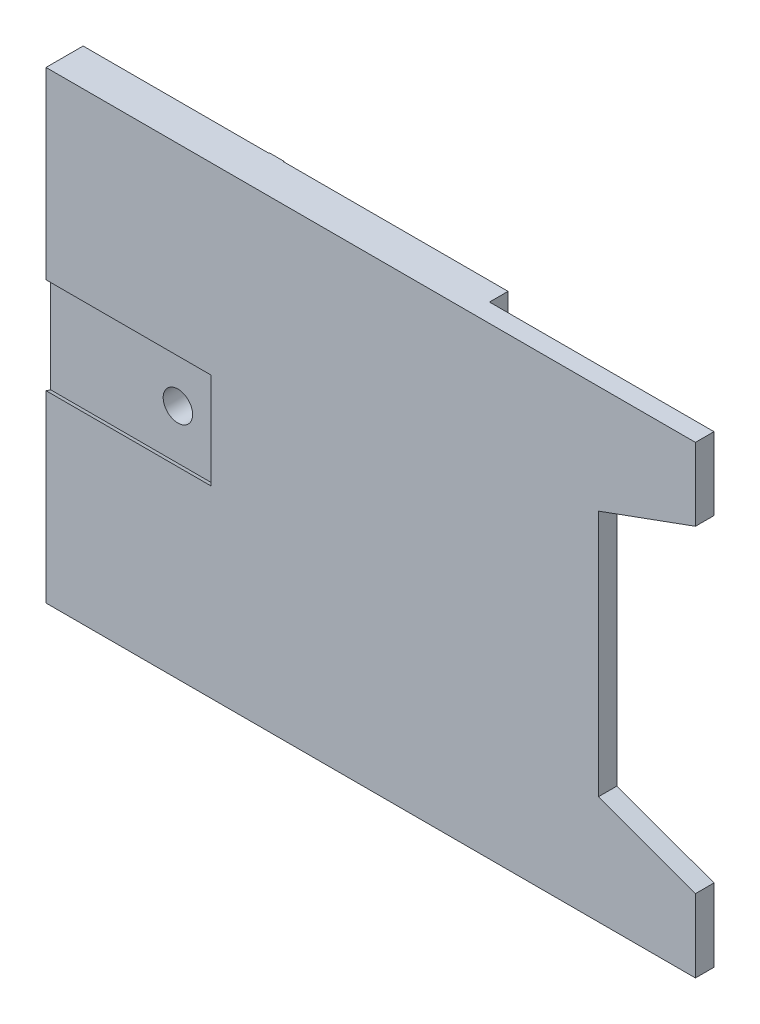
ISO-10303-21;
HEADER;
FILE_DESCRIPTION(('STEP AP214'),'2;1');
FILE_NAME('part.step','',(''),(''),'','','');
FILE_SCHEMA(('AUTOMOTIVE_DESIGN { 1 0 10303 214 1 1 1 1 }'));
ENDSEC;
DATA;
#1=APPLICATION_CONTEXT('core data for automotive mechanical design processes');
#2=APPLICATION_PROTOCOL_DEFINITION('international standard','automotive_design',2000,#1);
#3=PRODUCT_CONTEXT('',#1,'mechanical');
#4=PRODUCT('Part','Part','',(#3));
#5=PRODUCT_RELATED_PRODUCT_CATEGORY('part','',(#4));
#6=PRODUCT_DEFINITION_FORMATION('','',#4);
#7=PRODUCT_DEFINITION_CONTEXT('part definition',#1,'design');
#8=PRODUCT_DEFINITION('design','',#6,#7);
#9=PRODUCT_DEFINITION_SHAPE('','',#8);
#10=(LENGTH_UNIT() NAMED_UNIT(*) SI_UNIT(.MILLI.,.METRE.));
#11=(NAMED_UNIT(*) PLANE_ANGLE_UNIT() SI_UNIT($,.RADIAN.));
#12=(NAMED_UNIT(*) SI_UNIT($,.STERADIAN.) SOLID_ANGLE_UNIT());
#13=UNCERTAINTY_MEASURE_WITH_UNIT(LENGTH_MEASURE(1.E-05),#10,'distance_accuracy_value','');
#14=(GEOMETRIC_REPRESENTATION_CONTEXT(3) GLOBAL_UNCERTAINTY_ASSIGNED_CONTEXT((#13)) GLOBAL_UNIT_ASSIGNED_CONTEXT((#10,
#11,#12)) REPRESENTATION_CONTEXT('',''));
#15=CARTESIAN_POINT('',(0.,0.,0.));
#16=DIRECTION('',(0.,0.,1.));
#17=DIRECTION('',(1.,0.,0.));
#18=AXIS2_PLACEMENT_3D('',#15,#16,#17);
#19=CARTESIAN_POINT('',(0.,0.,4.));
#20=DIRECTION('',(0.,1.,0.));
#21=DIRECTION('',(0.,0.,1.));
#22=AXIS2_PLACEMENT_3D('',#19,#20,#21);
#23=PLANE('',#22);
#24=DIRECTION('',(0.,0.,1.));
#25=VECTOR('',#24,1.);
#26=CARTESIAN_POINT('',(25.8029900343161,0.,0.));
#27=LINE('',#26,#25);
#28=CARTESIAN_POINT('',(25.8029900343161,0.,0.));
#29=VERTEX_POINT('',#28);
#30=CARTESIAN_POINT('',(25.8029900343161,0.,2.));
#31=VERTEX_POINT('',#30);
#32=EDGE_CURVE('E298',#29,#31,#27,.T.);
#33=ORIENTED_EDGE('',*,*,#32,.T.);
#34=DIRECTION('',(1.,0.,0.));
#35=VECTOR('',#34,1.);
#36=CARTESIAN_POINT('',(25.8029900343161,0.,2.));
#37=LINE('',#36,#35);
#38=CARTESIAN_POINT('',(50.,0.,2.));
#39=VERTEX_POINT('',#38);
#40=EDGE_CURVE('E301',#31,#39,#37,.T.);
#41=ORIENTED_EDGE('',*,*,#40,.T.);
#42=DIRECTION('',(0.,0.,-1.));
#43=VECTOR('',#42,1.);
#44=CARTESIAN_POINT('',(50.,0.,4.));
#45=LINE('',#44,#43);
#46=CARTESIAN_POINT('',(50.,0.,4.));
#47=VERTEX_POINT('',#46);
#48=EDGE_CURVE('E11',#47,#39,#45,.T.);
#49=ORIENTED_EDGE('',*,*,#48,.F.);
#50=DIRECTION('',(1.,0.,0.));
#51=VECTOR('',#50,1.);
#52=CARTESIAN_POINT('',(0.,0.,4.));
#53=LINE('',#52,#51);
#54=CARTESIAN_POINT('',(-20.,0.,4.));
#55=VERTEX_POINT('',#54);
#56=EDGE_CURVE('E327',#55,#47,#53,.T.);
#57=ORIENTED_EDGE('',*,*,#56,.F.);
#58=DIRECTION('',(0.,0.,1.));
#59=VECTOR('',#58,1.);
#60=CARTESIAN_POINT('',(-20.,0.,0.));
#61=LINE('',#60,#59);
#62=CARTESIAN_POINT('',(-20.,0.,0.));
#63=VERTEX_POINT('',#62);
#64=EDGE_CURVE('E283',#63,#55,#61,.T.);
#65=ORIENTED_EDGE('',*,*,#64,.F.);
#66=DIRECTION('',(1.,0.,0.));
#67=VECTOR('',#66,1.);
#68=CARTESIAN_POINT('',(0.,0.,0.));
#69=LINE('',#68,#67);
#70=EDGE_CURVE('E326',#63,#29,#69,.T.);
#71=ORIENTED_EDGE('',*,*,#70,.T.);
#72=EDGE_LOOP('',(#33,#41,#49,#57,#65,#71));
#73=FACE_BOUND('',#72,.T.);
#74=ADVANCED_FACE('F35',(#73),#23,.F.);
#75=CARTESIAN_POINT('',(50.,0.,4.));
#76=DIRECTION('',(-1.,0.,0.));
#77=DIRECTION('',(0.,-1.,0.));
#78=AXIS2_PLACEMENT_3D('',#75,#76,#77);
#79=PLANE('',#78);
#80=ORIENTED_EDGE('',*,*,#48,.T.);
#81=DIRECTION('',(0.,1.,0.));
#82=VECTOR('',#81,1.);
#83=CARTESIAN_POINT('',(50.,0.,2.));
#84=LINE('',#83,#82);
#85=CARTESIAN_POINT('',(50.,7.874,2.));
#86=VERTEX_POINT('',#85);
#87=EDGE_CURVE('E310',#39,#86,#84,.T.);
#88=ORIENTED_EDGE('',*,*,#87,.T.);
#89=DIRECTION('',(0.,0.,-1.));
#90=VECTOR('',#89,1.);
#91=CARTESIAN_POINT('',(50.,7.874,4.));
#92=LINE('',#91,#90);
#93=CARTESIAN_POINT('',(50.,7.874,4.));
#94=VERTEX_POINT('',#93);
#95=EDGE_CURVE('E43',#94,#86,#92,.T.);
#96=ORIENTED_EDGE('',*,*,#95,.F.);
#97=DIRECTION('',(0.,1.,0.));
#98=VECTOR('',#97,1.);
#99=CARTESIAN_POINT('',(50.,0.,4.));
#100=LINE('',#99,#98);
#101=EDGE_CURVE('E329',#47,#94,#100,.T.);
#102=ORIENTED_EDGE('',*,*,#101,.F.);
#103=EDGE_LOOP('',(#80,#88,#96,#102));
#104=FACE_BOUND('',#103,.T.);
#105=ADVANCED_FACE('F370',(#104),#79,.F.);
#106=CARTESIAN_POINT('',(39.535978332,11.684,4.));
#107=DIRECTION('',(-0.342131753657188,-0.939651990440853,0.));
#108=DIRECTION('',(0.939651990440853,-0.342131753657188,0.));
#109=AXIS2_PLACEMENT_3D('',#106,#107,#108);
#110=PLANE('',#109);
#111=ORIENTED_EDGE('',*,*,#95,.T.);
#112=DIRECTION('',(-0.939651990440853,0.342131753657188,0.));
#113=VECTOR('',#112,1.);
#114=CARTESIAN_POINT('',(39.535978332,11.684,2.));
#115=LINE('',#114,#113);
#116=CARTESIAN_POINT('',(39.535978332,11.684,2.));
#117=VERTEX_POINT('',#116);
#118=EDGE_CURVE('E323',#86,#117,#115,.T.);
#119=ORIENTED_EDGE('',*,*,#118,.T.);
#120=DIRECTION('',(0.,0.,-1.));
#121=VECTOR('',#120,1.);
#122=CARTESIAN_POINT('',(39.535978332,11.684,4.));
#123=LINE('',#122,#121);
#124=CARTESIAN_POINT('',(39.535978332,11.684,4.));
#125=VERTEX_POINT('',#124);
#126=EDGE_CURVE('E357',#125,#117,#123,.T.);
#127=ORIENTED_EDGE('',*,*,#126,.F.);
#128=DIRECTION('',(-0.939651990440853,0.342131753657188,0.));
#129=VECTOR('',#128,1.);
#130=CARTESIAN_POINT('',(39.535978332,11.684,4.));
#131=LINE('',#130,#129);
#132=EDGE_CURVE('E331',#94,#125,#131,.T.);
#133=ORIENTED_EDGE('',*,*,#132,.F.);
#134=EDGE_LOOP('',(#111,#119,#127,#133));
#135=FACE_BOUND('',#134,.T.);
#136=ADVANCED_FACE('F366',(#135),#110,.F.);
#137=CARTESIAN_POINT('',(39.535978332,38.354,4.));
#138=DIRECTION('',(-1.,0.,0.));
#139=DIRECTION('',(0.,-1.,0.));
#140=AXIS2_PLACEMENT_3D('',#137,#138,#139);
#141=PLANE('',#140);
#142=ORIENTED_EDGE('',*,*,#126,.T.);
#143=DIRECTION('',(0.,1.,0.));
#144=VECTOR('',#143,1.);
#145=CARTESIAN_POINT('',(39.535978332,38.354,2.));
#146=LINE('',#145,#144);
#147=CARTESIAN_POINT('',(39.535978332,38.354,2.));
#148=VERTEX_POINT('',#147);
#149=EDGE_CURVE('E320',#117,#148,#146,.T.);
#150=ORIENTED_EDGE('',*,*,#149,.T.);
#151=DIRECTION('',(0.,0.,-1.));
#152=VECTOR('',#151,1.);
#153=CARTESIAN_POINT('',(39.535978332,38.354,4.));
#154=LINE('',#153,#152);
#155=CARTESIAN_POINT('',(39.535978332,38.354,4.));
#156=VERTEX_POINT('',#155);
#157=EDGE_CURVE('E354',#156,#148,#154,.T.);
#158=ORIENTED_EDGE('',*,*,#157,.F.);
#159=DIRECTION('',(0.,1.,0.));
#160=VECTOR('',#159,1.);
#161=CARTESIAN_POINT('',(39.535978332,38.354,4.));
#162=LINE('',#161,#160);
#163=EDGE_CURVE('E333',#125,#156,#162,.T.);
#164=ORIENTED_EDGE('',*,*,#163,.F.);
#165=EDGE_LOOP('',(#142,#150,#158,#164));
#166=FACE_BOUND('',#165,.T.);
#167=ADVANCED_FACE('F402',(#166),#141,.F.);
#168=CARTESIAN_POINT('',(39.535978332,38.354,4.));
#169=DIRECTION('',(-0.342131753657188,0.939651990440853,0.));
#170=DIRECTION('',(-0.939651990440853,-0.342131753657188,0.));
#171=AXIS2_PLACEMENT_3D('',#168,#169,#170);
#172=PLANE('',#171);
#173=ORIENTED_EDGE('',*,*,#157,.T.);
#174=DIRECTION('',(0.939651990440853,0.342131753657188,0.));
#175=VECTOR('',#174,1.);
#176=CARTESIAN_POINT('',(39.535978332,38.354,2.));
#177=LINE('',#176,#175);
#178=CARTESIAN_POINT('',(50.,42.164,2.));
#179=VERTEX_POINT('',#178);
#180=EDGE_CURVE('E313',#148,#179,#177,.T.);
#181=ORIENTED_EDGE('',*,*,#180,.T.);
#182=DIRECTION('',(0.,0.,-1.));
#183=VECTOR('',#182,1.);
#184=CARTESIAN_POINT('',(50.,42.164,4.));
#185=LINE('',#184,#183);
#186=CARTESIAN_POINT('',(50.,42.164,4.));
#187=VERTEX_POINT('',#186);
#188=EDGE_CURVE('E351',#187,#179,#185,.T.);
#189=ORIENTED_EDGE('',*,*,#188,.F.);
#190=DIRECTION('',(0.939651990440853,0.342131753657188,0.));
#191=VECTOR('',#190,1.);
#192=CARTESIAN_POINT('',(39.535978332,38.354,4.));
#193=LINE('',#192,#191);
#194=EDGE_CURVE('E335',#156,#187,#193,.T.);
#195=ORIENTED_EDGE('',*,*,#194,.F.);
#196=EDGE_LOOP('',(#173,#181,#189,#195));
#197=FACE_BOUND('',#196,.T.);
#198=ADVANCED_FACE('F399',(#197),#172,.F.);
#199=CARTESIAN_POINT('',(50.,42.164,4.));
#200=DIRECTION('',(-1.,0.,0.));
#201=DIRECTION('',(0.,0.,1.));
#202=AXIS2_PLACEMENT_3D('',#199,#200,#201);
#203=PLANE('',#202);
#204=ORIENTED_EDGE('',*,*,#188,.T.);
#205=CARTESIAN_POINT('',(50.,50.,2.));
#206=VERTEX_POINT('',#205);
#207=EDGE_CURVE('E314',#179,#206,#84,.T.);
#208=ORIENTED_EDGE('',*,*,#207,.T.);
#209=DIRECTION('',(0.,0.,-1.));
#210=VECTOR('',#209,1.);
#211=CARTESIAN_POINT('',(50.,50.,4.));
#212=LINE('',#211,#210);
#213=CARTESIAN_POINT('',(50.,50.,4.));
#214=VERTEX_POINT('',#213);
#215=EDGE_CURVE('E341',#214,#206,#212,.T.);
#216=ORIENTED_EDGE('',*,*,#215,.F.);
#217=DIRECTION('',(0.,1.,0.));
#218=VECTOR('',#217,1.);
#219=CARTESIAN_POINT('',(50.,42.164,4.));
#220=LINE('',#219,#218);
#221=EDGE_CURVE('E337',#187,#214,#220,.T.);
#222=ORIENTED_EDGE('',*,*,#221,.F.);
#223=EDGE_LOOP('',(#204,#208,#216,#222));
#224=FACE_BOUND('',#223,.T.);
#225=ADVANCED_FACE('F394',(#224),#203,.F.);
#226=CARTESIAN_POINT('',(1.60598006863211,50.,4.));
#227=DIRECTION('',(0.,-1.,0.));
#228=DIRECTION('',(0.,0.,-1.));
#229=AXIS2_PLACEMENT_3D('',#226,#227,#228);
#230=PLANE('',#229);
#231=ORIENTED_EDGE('',*,*,#215,.T.);
#232=DIRECTION('',(1.,0.,0.));
#233=VECTOR('',#232,1.);
#234=CARTESIAN_POINT('',(25.8029900343161,50.,2.));
#235=LINE('',#234,#233);
#236=CARTESIAN_POINT('',(25.8029900343161,50.,2.));
#237=VERTEX_POINT('',#236);
#238=EDGE_CURVE('E302',#237,#206,#235,.T.);
#239=ORIENTED_EDGE('',*,*,#238,.F.);
#240=DIRECTION('',(0.,0.,1.));
#241=VECTOR('',#240,1.);
#242=CARTESIAN_POINT('',(25.8029900343161,50.,0.));
#243=LINE('',#242,#241);
#244=CARTESIAN_POINT('',(25.8029900343161,50.,0.));
#245=VERTEX_POINT('',#244);
#246=EDGE_CURVE('E306',#245,#237,#243,.T.);
#247=ORIENTED_EDGE('',*,*,#246,.F.);
#248=DIRECTION('',(-1.,0.,0.));
#249=VECTOR('',#248,1.);
#250=CARTESIAN_POINT('',(1.60598006863211,50.,0.));
#251=LINE('',#250,#249);
#252=CARTESIAN_POINT('',(1.60598006863211,50.,0.));
#253=VERTEX_POINT('',#252);
#254=EDGE_CURVE('E344',#245,#253,#251,.T.);
#255=ORIENTED_EDGE('',*,*,#254,.T.);
#256=DIRECTION('',(0.,0.,1.));
#257=VECTOR('',#256,1.);
#258=CARTESIAN_POINT('',(1.60598006863211,50.,-0.0639999999999998));
#259=LINE('',#258,#257);
#260=CARTESIAN_POINT('',(1.60598006863211,50.,-0.0639999999999998));
#261=VERTEX_POINT('',#260);
#262=EDGE_CURVE('E217',#261,#253,#259,.T.);
#263=ORIENTED_EDGE('',*,*,#262,.F.);
#264=DIRECTION('',(-1.,0.,0.));
#265=VECTOR('',#264,1.);
#266=CARTESIAN_POINT('',(0.,50.,-0.0639999999999998));
#267=LINE('',#266,#265);
#268=CARTESIAN_POINT('',(0.,50.,-0.0639999999999998));
#269=VERTEX_POINT('',#268);
#270=EDGE_CURVE('E197',#261,#269,#267,.T.);
#271=ORIENTED_EDGE('',*,*,#270,.T.);
#272=DIRECTION('',(0.,0.,1.));
#273=VECTOR('',#272,1.);
#274=CARTESIAN_POINT('',(0.,50.,-0.0639999999999998));
#275=LINE('',#274,#273);
#276=CARTESIAN_POINT('',(0.,50.,0.));
#277=VERTEX_POINT('',#276);
#278=EDGE_CURVE('E211',#269,#277,#275,.T.);
#279=ORIENTED_EDGE('',*,*,#278,.T.);
#280=DIRECTION('',(1.,0.,0.));
#281=VECTOR('',#280,1.);
#282=CARTESIAN_POINT('',(-20.,50.,0.));
#283=LINE('',#282,#281);
#284=CARTESIAN_POINT('',(-20.,50.,0.));
#285=VERTEX_POINT('',#284);
#286=EDGE_CURVE('E293',#285,#277,#283,.T.);
#287=ORIENTED_EDGE('',*,*,#286,.F.);
#288=DIRECTION('',(0.,0.,-1.));
#289=VECTOR('',#288,1.);
#290=CARTESIAN_POINT('',(-20.,50.,0.));
#291=LINE('',#290,#289);
#292=CARTESIAN_POINT('',(-20.,50.,4.));
#293=VERTEX_POINT('',#292);
#294=EDGE_CURVE('E291',#293,#285,#291,.T.);
#295=ORIENTED_EDGE('',*,*,#294,.F.);
#296=DIRECTION('',(-1.,0.,0.));
#297=VECTOR('',#296,1.);
#298=CARTESIAN_POINT('',(1.60598006863211,50.,4.));
#299=LINE('',#298,#297);
#300=EDGE_CURVE('E339',#214,#293,#299,.T.);
#301=ORIENTED_EDGE('',*,*,#300,.F.);
#302=EDGE_LOOP('',(#231,#239,#247,#255,#263,#271,#279,#287,#295,#301));
#303=FACE_BOUND('',#302,.T.);
#304=ADVANCED_FACE('F388',(#303),#230,.F.);
#305=CARTESIAN_POINT('',(0.,0.,4.));
#306=DIRECTION('',(0.,0.,-1.));
#307=DIRECTION('',(-1.,0.,0.));
#308=AXIS2_PLACEMENT_3D('',#305,#306,#307);
#309=PLANE('',#308);
#310=DIRECTION('',(0.,1.,0.));
#311=VECTOR('',#310,1.);
#312=CARTESIAN_POINT('',(-20.,0.,4.));
#313=LINE('',#312,#311);
#314=CARTESIAN_POINT('',(-20.,30.1770058924054,4.));
#315=VERTEX_POINT('',#314);
#316=EDGE_CURVE('E287',#315,#293,#313,.T.);
#317=ORIENTED_EDGE('',*,*,#316,.F.);
#318=DIRECTION('',(-1.,0.,0.));
#319=VECTOR('',#318,1.);
#320=CARTESIAN_POINT('',(-2.22,30.1770058924054,4.));
#321=LINE('',#320,#319);
#322=CARTESIAN_POINT('',(-2.22,30.1770058924054,4.));
#323=VERTEX_POINT('',#322);
#324=EDGE_CURVE('E244',#323,#315,#321,.T.);
#325=ORIENTED_EDGE('',*,*,#324,.F.);
#326=DIRECTION('',(0.,1.,0.));
#327=VECTOR('',#326,1.);
#328=CARTESIAN_POINT('',(-2.22,30.1770058924054,4.));
#329=LINE('',#328,#327);
#330=CARTESIAN_POINT('',(-2.22,19.8229941075946,4.));
#331=VERTEX_POINT('',#330);
#332=EDGE_CURVE('E235',#331,#323,#329,.T.);
#333=ORIENTED_EDGE('',*,*,#332,.F.);
#334=DIRECTION('',(-1.,0.,0.));
#335=VECTOR('',#334,1.);
#336=CARTESIAN_POINT('',(-2.22,19.8229941075946,4.));
#337=LINE('',#336,#335);
#338=CARTESIAN_POINT('',(-20.,19.8229941075946,4.));
#339=VERTEX_POINT('',#338);
#340=EDGE_CURVE('E247',#331,#339,#337,.T.);
#341=ORIENTED_EDGE('',*,*,#340,.T.);
#342=EDGE_CURVE('E288',#55,#339,#313,.T.);
#343=ORIENTED_EDGE('',*,*,#342,.F.);
#344=ORIENTED_EDGE('',*,*,#56,.T.);
#345=ORIENTED_EDGE('',*,*,#101,.T.);
#346=ORIENTED_EDGE('',*,*,#132,.T.);
#347=ORIENTED_EDGE('',*,*,#163,.T.);
#348=ORIENTED_EDGE('',*,*,#194,.T.);
#349=ORIENTED_EDGE('',*,*,#221,.T.);
#350=ORIENTED_EDGE('',*,*,#300,.T.);
#351=EDGE_LOOP('',(#317,#325,#333,#341,#343,#344,#345,#346,#347,#348,#349,#350));
#352=FACE_BOUND('',#351,.T.);
#353=ADVANCED_FACE('F406',(#352),#309,.F.);
#354=CARTESIAN_POINT('',(0.,0.,0.));
#355=DIRECTION('',(0.,0.,-1.));
#356=DIRECTION('',(-1.,0.,0.));
#357=AXIS2_PLACEMENT_3D('',#354,#355,#356);
#358=PLANE('',#357);
#359=DIRECTION('',(-1.,0.,0.));
#360=VECTOR('',#359,1.);
#361=CARTESIAN_POINT('',(-2.22,30.1770058924054,0.));
#362=LINE('',#361,#360);
#363=CARTESIAN_POINT('',(-2.22,30.1770058924054,0.));
#364=VERTEX_POINT('',#363);
#365=CARTESIAN_POINT('',(-20.,30.1770058924054,0.));
#366=VERTEX_POINT('',#365);
#367=EDGE_CURVE('E266',#364,#366,#362,.T.);
#368=ORIENTED_EDGE('',*,*,#367,.T.);
#369=DIRECTION('',(0.,-1.,0.));
#370=VECTOR('',#369,1.);
#371=CARTESIAN_POINT('',(-20.,0.,0.));
#372=LINE('',#371,#370);
#373=EDGE_CURVE('E280',#285,#366,#372,.T.);
#374=ORIENTED_EDGE('',*,*,#373,.F.);
#375=ORIENTED_EDGE('',*,*,#286,.T.);
#376=DIRECTION('',(0.,-1.,0.));
#377=VECTOR('',#376,1.);
#378=CARTESIAN_POINT('',(0.,0.,0.));
#379=LINE('',#378,#377);
#380=CARTESIAN_POINT('',(0.,47.46,0.));
#381=VERTEX_POINT('',#380);
#382=EDGE_CURVE('E274',#277,#381,#379,.T.);
#383=ORIENTED_EDGE('',*,*,#382,.T.);
#384=DIRECTION('',(-1.,0.,0.));
#385=VECTOR('',#384,1.);
#386=CARTESIAN_POINT('',(0.,47.46,0.));
#387=LINE('',#386,#385);
#388=CARTESIAN_POINT('',(1.60598006863211,47.46,0.));
#389=VERTEX_POINT('',#388);
#390=EDGE_CURVE('E192',#389,#381,#387,.T.);
#391=ORIENTED_EDGE('',*,*,#390,.F.);
#392=DIRECTION('',(0.,-1.,0.));
#393=VECTOR('',#392,1.);
#394=CARTESIAN_POINT('',(1.60598006863211,47.46,0.));
#395=LINE('',#394,#393);
#396=EDGE_CURVE('E347',#253,#389,#395,.T.);
#397=ORIENTED_EDGE('',*,*,#396,.F.);
#398=ORIENTED_EDGE('',*,*,#254,.F.);
#399=DIRECTION('',(0.,1.,0.));
#400=VECTOR('',#399,1.);
#401=CARTESIAN_POINT('',(25.8029900343161,0.,0.));
#402=LINE('',#401,#400);
#403=EDGE_CURVE('E305',#29,#245,#402,.T.);
#404=ORIENTED_EDGE('',*,*,#403,.F.);
#405=ORIENTED_EDGE('',*,*,#70,.F.);
#406=CARTESIAN_POINT('',(-20.,19.8229941075946,0.));
#407=VERTEX_POINT('',#406);
#408=EDGE_CURVE('E284',#407,#63,#372,.T.);
#409=ORIENTED_EDGE('',*,*,#408,.F.);
#410=DIRECTION('',(-1.,0.,0.));
#411=VECTOR('',#410,1.);
#412=CARTESIAN_POINT('',(-2.22,19.8229941075946,0.));
#413=LINE('',#412,#411);
#414=CARTESIAN_POINT('',(-2.22,19.8229941075946,0.));
#415=VERTEX_POINT('',#414);
#416=EDGE_CURVE('E59',#415,#407,#413,.T.);
#417=ORIENTED_EDGE('',*,*,#416,.F.);
#418=DIRECTION('',(0.,-1.,0.));
#419=VECTOR('',#418,1.);
#420=CARTESIAN_POINT('',(-2.22,30.1770058924054,0.));
#421=LINE('',#420,#419);
#422=EDGE_CURVE('E256',#364,#415,#421,.T.);
#423=ORIENTED_EDGE('',*,*,#422,.F.);
#424=EDGE_LOOP('',(#368,#374,#375,#383,#391,#397,#398,#404,#405,#409,#417,#423));
#425=FACE_BOUND('',#424,.T.);
#426=ADVANCED_FACE('F384',(#425),#358,.T.);
#427=CARTESIAN_POINT('',(25.8029900343161,0.,2.));
#428=DIRECTION('',(0.,0.,1.));
#429=DIRECTION('',(1.,0.,0.));
#430=AXIS2_PLACEMENT_3D('',#427,#428,#429);
#431=PLANE('',#430);
#432=ORIENTED_EDGE('',*,*,#87,.F.);
#433=ORIENTED_EDGE('',*,*,#40,.F.);
#434=DIRECTION('',(0.,1.,0.));
#435=VECTOR('',#434,1.);
#436=CARTESIAN_POINT('',(25.8029900343161,0.,2.));
#437=LINE('',#436,#435);
#438=EDGE_CURVE('E315',#31,#237,#437,.T.);
#439=ORIENTED_EDGE('',*,*,#438,.T.);
#440=ORIENTED_EDGE('',*,*,#238,.T.);
#441=ORIENTED_EDGE('',*,*,#207,.F.);
#442=ORIENTED_EDGE('',*,*,#180,.F.);
#443=ORIENTED_EDGE('',*,*,#149,.F.);
#444=ORIENTED_EDGE('',*,*,#118,.F.);
#445=EDGE_LOOP('',(#432,#433,#439,#440,#441,#442,#443,#444));
#446=FACE_BOUND('',#445,.T.);
#447=ADVANCED_FACE('F374',(#446),#431,.F.);
#448=CARTESIAN_POINT('',(25.8029900343161,0.,0.));
#449=DIRECTION('',(-1.,0.,0.));
#450=DIRECTION('',(0.,0.,1.));
#451=AXIS2_PLACEMENT_3D('',#448,#449,#450);
#452=PLANE('',#451);
#453=ORIENTED_EDGE('',*,*,#246,.T.);
#454=ORIENTED_EDGE('',*,*,#438,.F.);
#455=ORIENTED_EDGE('',*,*,#32,.F.);
#456=ORIENTED_EDGE('',*,*,#403,.T.);
#457=EDGE_LOOP('',(#453,#454,#455,#456));
#458=FACE_BOUND('',#457,.T.);
#459=ADVANCED_FACE('F380',(#458),#452,.F.);
#460=CARTESIAN_POINT('',(-20.,0.,0.));
#461=DIRECTION('',(1.,0.,0.));
#462=DIRECTION('',(0.,0.,-1.));
#463=AXIS2_PLACEMENT_3D('',#460,#461,#462);
#464=PLANE('',#463);
#465=DIRECTION('',(0.,-1.,0.));
#466=VECTOR('',#465,1.);
#467=CARTESIAN_POINT('',(-20.,19.6566499263103,3.5));
#468=LINE('',#467,#466);
#469=CARTESIAN_POINT('',(-20.,30.3433500736897,3.5));
#470=VERTEX_POINT('',#469);
#471=CARTESIAN_POINT('',(-20.,19.6566499263103,3.5));
#472=VERTEX_POINT('',#471);
#473=EDGE_CURVE('E240',#470,#472,#468,.T.);
#474=ORIENTED_EDGE('',*,*,#473,.F.);
#475=CARTESIAN_POINT('',(-20.,25.,2.));
#476=DIRECTION('',(-1.,0.,0.));
#477=DIRECTION('',(0.,0.,1.));
#478=AXIS2_PLACEMENT_3D('',#475,#476,#477);
#479=CIRCLE('',#478,5.5499);
#480=EDGE_CURVE('E51',#315,#470,#479,.T.);
#481=ORIENTED_EDGE('',*,*,#480,.F.);
#482=ORIENTED_EDGE('',*,*,#316,.T.);
#483=ORIENTED_EDGE('',*,*,#294,.T.);
#484=ORIENTED_EDGE('',*,*,#373,.T.);
#485=CARTESIAN_POINT('',(-20.,25.,2.));
#486=DIRECTION('',(-1.,0.,0.));
#487=DIRECTION('',(0.,0.,1.));
#488=AXIS2_PLACEMENT_3D('',#485,#486,#487);
#489=CIRCLE('',#488,5.5499);
#490=CARTESIAN_POINT('',(-20.,30.3433500736897,0.5));
#491=VERTEX_POINT('',#490);
#492=EDGE_CURVE('E246',#491,#366,#489,.T.);
#493=ORIENTED_EDGE('',*,*,#492,.F.);
#494=DIRECTION('',(0.,1.,0.));
#495=VECTOR('',#494,1.);
#496=CARTESIAN_POINT('',(-20.,19.6566499263103,0.5));
#497=LINE('',#496,#495);
#498=CARTESIAN_POINT('',(-20.,19.6566499263103,0.5));
#499=VERTEX_POINT('',#498);
#500=EDGE_CURVE('E257',#499,#491,#497,.T.);
#501=ORIENTED_EDGE('',*,*,#500,.F.);
#502=CARTESIAN_POINT('',(-20.,25.,2.));
#503=DIRECTION('',(-1.,0.,0.));
#504=DIRECTION('',(0.,0.,1.));
#505=AXIS2_PLACEMENT_3D('',#502,#503,#504);
#506=CIRCLE('',#505,5.5499);
#507=EDGE_CURVE('E268',#407,#499,#506,.T.);
#508=ORIENTED_EDGE('',*,*,#507,.F.);
#509=ORIENTED_EDGE('',*,*,#408,.T.);
#510=ORIENTED_EDGE('',*,*,#64,.T.);
#511=ORIENTED_EDGE('',*,*,#342,.T.);
#512=CARTESIAN_POINT('',(-20.,25.,2.));
#513=DIRECTION('',(-1.,0.,0.));
#514=DIRECTION('',(0.,0.,1.));
#515=AXIS2_PLACEMENT_3D('',#512,#513,#514);
#516=CIRCLE('',#515,5.5499);
#517=EDGE_CURVE('E229',#472,#339,#516,.T.);
#518=ORIENTED_EDGE('',*,*,#517,.F.);
#519=EDGE_LOOP('',(#474,#481,#482,#483,#484,#493,#501,#508,#509,#510,#511,#518));
#520=FACE_BOUND('',#519,.T.);
#521=ADVANCED_FACE('F410',(#520),#464,.F.);
#522=CARTESIAN_POINT('',(-2.22,25.,2.));
#523=DIRECTION('',(-1.,0.,0.));
#524=DIRECTION('',(0.,0.,1.));
#525=AXIS2_PLACEMENT_3D('',#522,#523,#524);
#526=CYLINDRICAL_SURFACE('',#525,5.5499);
#527=ORIENTED_EDGE('',*,*,#492,.T.);
#528=ORIENTED_EDGE('',*,*,#367,.F.);
#529=CARTESIAN_POINT('',(-2.22,25.,2.));
#530=DIRECTION('',(-1.,0.,0.));
#531=DIRECTION('',(0.,0.,1.));
#532=AXIS2_PLACEMENT_3D('',#529,#530,#531);
#533=CIRCLE('',#532,5.5499);
#534=CARTESIAN_POINT('',(-2.22,30.3433500736897,0.5));
#535=VERTEX_POINT('',#534);
#536=EDGE_CURVE('E253',#535,#364,#533,.T.);
#537=ORIENTED_EDGE('',*,*,#536,.F.);
#538=DIRECTION('',(-1.,0.,0.));
#539=VECTOR('',#538,1.);
#540=CARTESIAN_POINT('',(-2.22,30.3433500736897,0.5));
#541=LINE('',#540,#539);
#542=EDGE_CURVE('E272',#535,#491,#541,.T.);
#543=ORIENTED_EDGE('',*,*,#542,.T.);
#544=EDGE_LOOP('',(#527,#528,#537,#543));
#545=FACE_BOUND('',#544,.T.);
#546=ADVANCED_FACE('F420',(#545),#526,.F.);
#547=CARTESIAN_POINT('',(-2.22,19.6566499263103,0.5));
#548=DIRECTION('',(0.,0.,1.));
#549=DIRECTION('',(1.,0.,0.));
#550=AXIS2_PLACEMENT_3D('',#547,#548,#549);
#551=PLANE('',#550);
#552=CARTESIAN_POINT('',(-6.284,25.,0.5));
#553=DIRECTION('',(0.,0.,1.));
#554=DIRECTION('',(1.,0.,0.));
#555=AXIS2_PLACEMENT_3D('',#552,#553,#554);
#556=CIRCLE('',#555,1.5875);
#557=CARTESIAN_POINT('',(-4.6965,25.,0.5));
#558=VERTEX_POINT('',#557);
#559=EDGE_CURVE('E222',#558,#558,#556,.T.);
#560=ORIENTED_EDGE('',*,*,#559,.T.);
#561=EDGE_LOOP('',(#560));
#562=FACE_BOUND('',#561,.T.);
#563=ORIENTED_EDGE('',*,*,#500,.T.);
#564=ORIENTED_EDGE('',*,*,#542,.F.);
#565=DIRECTION('',(0.,1.,0.));
#566=VECTOR('',#565,1.);
#567=CARTESIAN_POINT('',(-2.22,19.6566499263103,0.5));
#568=LINE('',#567,#566);
#569=CARTESIAN_POINT('',(-2.22,19.6566499263103,0.5));
#570=VERTEX_POINT('',#569);
#571=EDGE_CURVE('E263',#570,#535,#568,.T.);
#572=ORIENTED_EDGE('',*,*,#571,.F.);
#573=DIRECTION('',(-1.,0.,0.));
#574=VECTOR('',#573,1.);
#575=CARTESIAN_POINT('',(-2.22,19.6566499263103,0.5));
#576=LINE('',#575,#574);
#577=EDGE_CURVE('E275',#570,#499,#576,.T.);
#578=ORIENTED_EDGE('',*,*,#577,.T.);
#579=EDGE_LOOP('',(#563,#564,#572,#578));
#580=FACE_BOUND('',#579,.T.);
#581=ADVANCED_FACE('F476',(#562,#580),#551,.F.);
#582=CARTESIAN_POINT('',(-2.22,25.,2.));
#583=DIRECTION('',(-1.,0.,0.));
#584=DIRECTION('',(0.,0.,1.));
#585=AXIS2_PLACEMENT_3D('',#582,#583,#584);
#586=CYLINDRICAL_SURFACE('',#585,5.5499);
#587=ORIENTED_EDGE('',*,*,#507,.T.);
#588=ORIENTED_EDGE('',*,*,#577,.F.);
#589=CARTESIAN_POINT('',(-2.22,25.,2.));
#590=DIRECTION('',(-1.,0.,0.));
#591=DIRECTION('',(0.,0.,1.));
#592=AXIS2_PLACEMENT_3D('',#589,#590,#591);
#593=CIRCLE('',#592,5.5499);
#594=EDGE_CURVE('E260',#415,#570,#593,.T.);
#595=ORIENTED_EDGE('',*,*,#594,.F.);
#596=ORIENTED_EDGE('',*,*,#416,.T.);
#597=EDGE_LOOP('',(#587,#588,#595,#596));
#598=FACE_BOUND('',#597,.T.);
#599=ADVANCED_FACE('F477',(#598),#586,.F.);
#600=CARTESIAN_POINT('',(-2.22,25.,2.));
#601=DIRECTION('',(-1.,0.,0.));
#602=DIRECTION('',(0.,0.,1.));
#603=AXIS2_PLACEMENT_3D('',#600,#601,#602);
#604=PLANE('',#603);
#605=ORIENTED_EDGE('',*,*,#536,.T.);
#606=ORIENTED_EDGE('',*,*,#422,.T.);
#607=ORIENTED_EDGE('',*,*,#594,.T.);
#608=ORIENTED_EDGE('',*,*,#571,.T.);
#609=EDGE_LOOP('',(#605,#606,#607,#608));
#610=FACE_BOUND('',#609,.T.);
#611=ADVANCED_FACE('F416',(#610),#604,.T.);
#612=CARTESIAN_POINT('',(-2.22,25.,2.));
#613=DIRECTION('',(-1.,0.,0.));
#614=DIRECTION('',(0.,0.,1.));
#615=AXIS2_PLACEMENT_3D('',#612,#613,#614);
#616=CYLINDRICAL_SURFACE('',#615,5.5499);
#617=ORIENTED_EDGE('',*,*,#480,.T.);
#618=DIRECTION('',(-1.,0.,0.));
#619=VECTOR('',#618,1.);
#620=CARTESIAN_POINT('',(-2.22,30.3433500736897,3.5));
#621=LINE('',#620,#619);
#622=CARTESIAN_POINT('',(-2.22,30.3433500736897,3.5));
#623=VERTEX_POINT('',#622);
#624=EDGE_CURVE('E238',#623,#470,#621,.T.);
#625=ORIENTED_EDGE('',*,*,#624,.F.);
#626=CARTESIAN_POINT('',(-2.22,25.,2.));
#627=DIRECTION('',(-1.,0.,0.));
#628=DIRECTION('',(0.,0.,1.));
#629=AXIS2_PLACEMENT_3D('',#626,#627,#628);
#630=CIRCLE('',#629,5.5499);
#631=EDGE_CURVE('E225',#323,#623,#630,.T.);
#632=ORIENTED_EDGE('',*,*,#631,.F.);
#633=ORIENTED_EDGE('',*,*,#324,.T.);
#634=EDGE_LOOP('',(#617,#625,#632,#633));
#635=FACE_BOUND('',#634,.T.);
#636=ADVANCED_FACE('F431',(#635),#616,.F.);
#637=CARTESIAN_POINT('',(-2.22,25.,2.));
#638=DIRECTION('',(-1.,0.,0.));
#639=DIRECTION('',(0.,0.,1.));
#640=AXIS2_PLACEMENT_3D('',#637,#638,#639);
#641=CYLINDRICAL_SURFACE('',#640,5.5499);
#642=ORIENTED_EDGE('',*,*,#517,.T.);
#643=ORIENTED_EDGE('',*,*,#340,.F.);
#644=CARTESIAN_POINT('',(-2.22,25.,2.));
#645=DIRECTION('',(-1.,0.,0.));
#646=DIRECTION('',(0.,0.,1.));
#647=AXIS2_PLACEMENT_3D('',#644,#645,#646);
#648=CIRCLE('',#647,5.5499);
#649=CARTESIAN_POINT('',(-2.22,19.6566499263103,3.5));
#650=VERTEX_POINT('',#649);
#651=EDGE_CURVE('E232',#650,#331,#648,.T.);
#652=ORIENTED_EDGE('',*,*,#651,.F.);
#653=DIRECTION('',(-1.,0.,0.));
#654=VECTOR('',#653,1.);
#655=CARTESIAN_POINT('',(-2.22,19.6566499263103,3.5));
#656=LINE('',#655,#654);
#657=EDGE_CURVE('E250',#650,#472,#656,.T.);
#658=ORIENTED_EDGE('',*,*,#657,.T.);
#659=EDGE_LOOP('',(#642,#643,#652,#658));
#660=FACE_BOUND('',#659,.T.);
#661=ADVANCED_FACE('F436',(#660),#641,.F.);
#662=CARTESIAN_POINT('',(-2.22,19.6566499263103,3.5));
#663=DIRECTION('',(0.,0.,-1.));
#664=DIRECTION('',(-1.,0.,0.));
#665=AXIS2_PLACEMENT_3D('',#662,#663,#664);
#666=PLANE('',#665);
#667=CARTESIAN_POINT('',(-6.284,25.,3.5));
#668=DIRECTION('',(0.,0.,-1.));
#669=DIRECTION('',(-1.,0.,0.));
#670=AXIS2_PLACEMENT_3D('',#667,#668,#669);
#671=CIRCLE('',#670,1.5875);
#672=CARTESIAN_POINT('',(-7.8715,25.,3.5));
#673=VERTEX_POINT('',#672);
#674=EDGE_CURVE('E38',#673,#673,#671,.T.);
#675=ORIENTED_EDGE('',*,*,#674,.T.);
#676=EDGE_LOOP('',(#675));
#677=FACE_BOUND('',#676,.T.);
#678=ORIENTED_EDGE('',*,*,#473,.T.);
#679=ORIENTED_EDGE('',*,*,#657,.F.);
#680=DIRECTION('',(0.,-1.,0.));
#681=VECTOR('',#680,1.);
#682=CARTESIAN_POINT('',(-2.22,19.6566499263103,3.5));
#683=LINE('',#682,#681);
#684=EDGE_CURVE('E228',#623,#650,#683,.T.);
#685=ORIENTED_EDGE('',*,*,#684,.F.);
#686=ORIENTED_EDGE('',*,*,#624,.T.);
#687=EDGE_LOOP('',(#678,#679,#685,#686));
#688=FACE_BOUND('',#687,.T.);
#689=ADVANCED_FACE('F428',(#677,#688),#666,.F.);
#690=CARTESIAN_POINT('',(-2.22,25.,2.));
#691=DIRECTION('',(-1.,0.,0.));
#692=DIRECTION('',(0.,0.,1.));
#693=AXIS2_PLACEMENT_3D('',#690,#691,#692);
#694=PLANE('',#693);
#695=ORIENTED_EDGE('',*,*,#631,.T.);
#696=ORIENTED_EDGE('',*,*,#684,.T.);
#697=ORIENTED_EDGE('',*,*,#651,.T.);
#698=ORIENTED_EDGE('',*,*,#332,.T.);
#699=EDGE_LOOP('',(#695,#696,#697,#698));
#700=FACE_BOUND('',#699,.T.);
#701=ADVANCED_FACE('F434',(#700),#694,.T.);
#702=CARTESIAN_POINT('',(-6.284,25.,4.00005));
#703=DIRECTION('',(0.,0.,-1.));
#704=DIRECTION('',(-1.,0.,0.));
#705=AXIS2_PLACEMENT_3D('',#702,#703,#704);
#706=CYLINDRICAL_SURFACE('',#705,1.5875);
#707=ORIENTED_EDGE('',*,*,#674,.F.);
#708=EDGE_LOOP('',(#707));
#709=FACE_BOUND('',#708,.T.);
#710=ORIENTED_EDGE('',*,*,#559,.F.);
#711=EDGE_LOOP('',(#710));
#712=FACE_BOUND('',#711,.T.);
#713=ADVANCED_FACE('F506',(#709,#712),#706,.F.);
#714=CARTESIAN_POINT('',(0.,50.,-0.0639999999999998));
#715=DIRECTION('',(-1.,0.,0.));
#716=DIRECTION('',(0.,-1.,0.));
#717=AXIS2_PLACEMENT_3D('',#714,#715,#716);
#718=PLANE('',#717);
#719=DIRECTION('',(0.,0.,1.));
#720=VECTOR('',#719,1.);
#721=CARTESIAN_POINT('',(0.,47.46,-0.0639999999999998));
#722=LINE('',#721,#720);
#723=CARTESIAN_POINT('',(0.,47.46,-0.0639999999999998));
#724=VERTEX_POINT('',#723);
#725=EDGE_CURVE('E186',#724,#381,#722,.T.);
#726=ORIENTED_EDGE('',*,*,#725,.T.);
#727=ORIENTED_EDGE('',*,*,#382,.F.);
#728=ORIENTED_EDGE('',*,*,#278,.F.);
#729=DIRECTION('',(0.,-1.,0.));
#730=VECTOR('',#729,1.);
#731=CARTESIAN_POINT('',(0.,50.,-0.0639999999999998));
#732=LINE('',#731,#730);
#733=EDGE_CURVE('E204',#269,#724,#732,.T.);
#734=ORIENTED_EDGE('',*,*,#733,.T.);
#735=EDGE_LOOP('',(#726,#727,#728,#734));
#736=FACE_BOUND('',#735,.T.);
#737=ADVANCED_FACE('F209',(#736),#718,.T.);
#738=CARTESIAN_POINT('',(1.60598006863211,50.,-0.0639999999999998));
#739=DIRECTION('',(1.,0.,0.));
#740=DIRECTION('',(0.,1.,0.));
#741=AXIS2_PLACEMENT_3D('',#738,#739,#740);
#742=PLANE('',#741);
#743=ORIENTED_EDGE('',*,*,#262,.T.);
#744=ORIENTED_EDGE('',*,*,#396,.T.);
#745=DIRECTION('',(0.,0.,1.));
#746=VECTOR('',#745,1.);
#747=CARTESIAN_POINT('',(1.60598006863211,47.46,-0.0639999999999998));
#748=LINE('',#747,#746);
#749=CARTESIAN_POINT('',(1.60598006863211,47.46,-0.0639999999999998));
#750=VERTEX_POINT('',#749);
#751=EDGE_CURVE('E196',#750,#389,#748,.T.);
#752=ORIENTED_EDGE('',*,*,#751,.F.);
#753=DIRECTION('',(0.,1.,0.));
#754=VECTOR('',#753,1.);
#755=CARTESIAN_POINT('',(1.60598006863211,50.,-0.0639999999999998));
#756=LINE('',#755,#754);
#757=EDGE_CURVE('E207',#750,#261,#756,.T.);
#758=ORIENTED_EDGE('',*,*,#757,.T.);
#759=EDGE_LOOP('',(#743,#744,#752,#758));
#760=FACE_BOUND('',#759,.T.);
#761=ADVANCED_FACE('F558',(#760),#742,.T.);
#762=CARTESIAN_POINT('',(0.,47.46,-0.0639999999999998));
#763=DIRECTION('',(0.,-1.,0.));
#764=DIRECTION('',(0.,0.,-1.));
#765=AXIS2_PLACEMENT_3D('',#762,#763,#764);
#766=PLANE('',#765);
#767=ORIENTED_EDGE('',*,*,#751,.T.);
#768=ORIENTED_EDGE('',*,*,#390,.T.);
#769=ORIENTED_EDGE('',*,*,#725,.F.);
#770=DIRECTION('',(1.,0.,0.));
#771=VECTOR('',#770,1.);
#772=CARTESIAN_POINT('',(0.,47.46,-0.0639999999999998));
#773=LINE('',#772,#771);
#774=EDGE_CURVE('E190',#724,#750,#773,.T.);
#775=ORIENTED_EDGE('',*,*,#774,.T.);
#776=EDGE_LOOP('',(#767,#768,#769,#775));
#777=FACE_BOUND('',#776,.T.);
#778=ADVANCED_FACE('F189',(#777),#766,.T.);
#779=CARTESIAN_POINT('',(0.,0.,-0.0639999999999998));
#780=DIRECTION('',(0.,0.,1.));
#781=DIRECTION('',(1.,0.,0.));
#782=AXIS2_PLACEMENT_3D('',#779,#780,#781);
#783=PLANE('',#782);
#784=ORIENTED_EDGE('',*,*,#733,.F.);
#785=ORIENTED_EDGE('',*,*,#270,.F.);
#786=ORIENTED_EDGE('',*,*,#757,.F.);
#787=ORIENTED_EDGE('',*,*,#774,.F.);
#788=EDGE_LOOP('',(#784,#785,#786,#787));
#789=FACE_BOUND('',#788,.T.);
#790=ADVANCED_FACE('F202',(#789),#783,.F.);
#791=CLOSED_SHELL('',(#74,#105,#136,#167,#198,#225,#304,#353,#426,#447,#459,#521,#546,#581,#599,
#611,#636,#661,#689,#701,#713,#737,#761,#778,#790));
#792=MANIFOLD_SOLID_BREP('B2',#791);
#793=ADVANCED_BREP_SHAPE_REPRESENTATION('',(#18,#792),#14);
#794=SHAPE_DEFINITION_REPRESENTATION(#9,#793);
ENDSEC;
END-ISO-10303-21;
